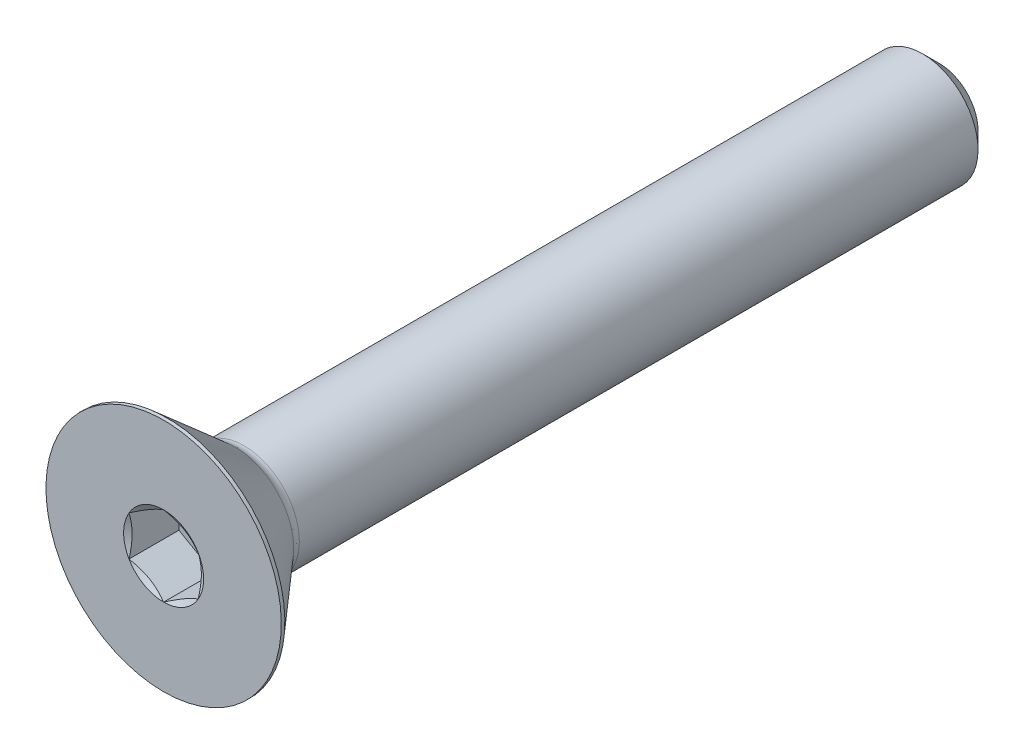
ISO-10303-21;
HEADER;
FILE_DESCRIPTION(('STEP AP214'),'2;1');
FILE_NAME('part.step','',(''),(''),'','','');
FILE_SCHEMA(('AUTOMOTIVE_DESIGN { 1 0 10303 214 1 1 1 1 }'));
ENDSEC;
DATA;
#1=APPLICATION_CONTEXT('core data for automotive mechanical design processes');
#2=APPLICATION_PROTOCOL_DEFINITION('international standard','automotive_design',2000,#1);
#3=PRODUCT_CONTEXT('',#1,'mechanical');
#4=PRODUCT('Part','Part','',(#3));
#5=PRODUCT_RELATED_PRODUCT_CATEGORY('part','',(#4));
#6=PRODUCT_DEFINITION_FORMATION('','',#4);
#7=PRODUCT_DEFINITION_CONTEXT('part definition',#1,'design');
#8=PRODUCT_DEFINITION('design','',#6,#7);
#9=PRODUCT_DEFINITION_SHAPE('','',#8);
#10=(LENGTH_UNIT() NAMED_UNIT(*) SI_UNIT(.MILLI.,.METRE.));
#11=(NAMED_UNIT(*) PLANE_ANGLE_UNIT() SI_UNIT($,.RADIAN.));
#12=(NAMED_UNIT(*) SI_UNIT($,.STERADIAN.) SOLID_ANGLE_UNIT());
#13=UNCERTAINTY_MEASURE_WITH_UNIT(LENGTH_MEASURE(1.E-05),#10,'distance_accuracy_value','');
#14=(GEOMETRIC_REPRESENTATION_CONTEXT(3) GLOBAL_UNCERTAINTY_ASSIGNED_CONTEXT((#13)) GLOBAL_UNIT_ASSIGNED_CONTEXT((#10,
#11,#12)) REPRESENTATION_CONTEXT('',''));
#15=CARTESIAN_POINT('',(0.,0.,0.));
#16=DIRECTION('',(0.,0.,1.));
#17=DIRECTION('',(1.,0.,0.));
#18=AXIS2_PLACEMENT_3D('',#15,#16,#17);
#19=CARTESIAN_POINT('',(0.,0.,-44.45));
#20=DIRECTION('',(0.,0.,-1.));
#21=DIRECTION('',(0.,1.,0.));
#22=AXIS2_PLACEMENT_3D('',#19,#20,#21);
#23=CYLINDRICAL_SURFACE('',#22,3.175);
#24=CARTESIAN_POINT('',(0.,0.,-4.60180899712601));
#25=DIRECTION('',(0.,0.,1.));
#26=DIRECTION('',(0.,-1.,0.));
#27=AXIS2_PLACEMENT_3D('',#24,#25,#26);
#28=CIRCLE('',#27,3.175);
#29=CARTESIAN_POINT('',(0.,-3.17500000000001,-4.60180899712601));
#30=VERTEX_POINT('',#29);
#31=EDGE_CURVE('E211',#30,#30,#28,.T.);
#32=ORIENTED_EDGE('',*,*,#31,.F.);
#33=EDGE_LOOP('',(#32));
#34=FACE_BOUND('',#33,.T.);
#35=CARTESIAN_POINT('',(0.,0.,-43.4975));
#36=DIRECTION('',(0.,0.,-1.));
#37=DIRECTION('',(0.,1.,0.));
#38=AXIS2_PLACEMENT_3D('',#35,#36,#37);
#39=CIRCLE('',#38,3.175);
#40=CARTESIAN_POINT('',(0.,3.17500000000001,-43.4975));
#41=VERTEX_POINT('',#40);
#42=EDGE_CURVE('E48',#41,#41,#39,.F.);
#43=ORIENTED_EDGE('',*,*,#42,.T.);
#44=EDGE_LOOP('',(#43));
#45=FACE_BOUND('',#44,.T.);
#46=ADVANCED_FACE('F34',(#34,#45),#23,.T.);
#47=CARTESIAN_POINT('',(0.,-3.175,-44.45));
#48=DIRECTION('',(0.,0.,-1.));
#49=DIRECTION('',(0.,1.,0.));
#50=AXIS2_PLACEMENT_3D('',#47,#48,#49);
#51=PLANE('',#50);
#52=CARTESIAN_POINT('',(0.,0.,-44.45));
#53=DIRECTION('',(0.,0.,-1.));
#54=DIRECTION('',(0.,1.,0.));
#55=AXIS2_PLACEMENT_3D('',#52,#53,#54);
#56=CIRCLE('',#55,2.22250000000001);
#57=CARTESIAN_POINT('',(0.,2.22250000000001,-44.45));
#58=VERTEX_POINT('',#57);
#59=EDGE_CURVE('E214',#58,#58,#56,.T.);
#60=ORIENTED_EDGE('',*,*,#59,.T.);
#61=EDGE_LOOP('',(#60));
#62=FACE_BOUND('',#61,.T.);
#63=ADVANCED_FACE('F223',(#62),#51,.T.);
#64=CARTESIAN_POINT('',(0.,0.,-44.45));
#65=DIRECTION('',(0.,0.,1.));
#66=DIRECTION('',(0.,-1.,0.));
#67=AXIS2_PLACEMENT_3D('',#64,#65,#66);
#68=CONICAL_SURFACE('',#67,2.22250000000001,0.785398163397447);
#69=ORIENTED_EDGE('',*,*,#42,.F.);
#70=EDGE_LOOP('',(#69));
#71=FACE_BOUND('',#70,.T.);
#72=ORIENTED_EDGE('',*,*,#59,.F.);
#73=EDGE_LOOP('',(#72));
#74=FACE_BOUND('',#73,.T.);
#75=ADVANCED_FACE('F36',(#71,#74),#68,.T.);
#76=CARTESIAN_POINT('',(0.,0.,-4.60180899712601));
#77=DIRECTION('',(0.,0.,1.));
#78=DIRECTION('',(0.,-1.,0.));
#79=AXIS2_PLACEMENT_3D('',#76,#77,#78);
#80=TOROIDAL_SURFACE('',#79,3.95604099552516,0.78104099552515);
#81=CARTESIAN_POINT('',(0.,0.,-4.0894));
#82=DIRECTION('',(0.,0.,1.));
#83=DIRECTION('',(0.,-1.,0.));
#84=AXIS2_PLACEMENT_3D('',#81,#82,#83);
#85=CIRCLE('',#84,3.36658187365559);
#86=CARTESIAN_POINT('',(0.,-3.36658187365559,-4.0894));
#87=VERTEX_POINT('',#86);
#88=EDGE_CURVE('E208',#87,#87,#85,.T.);
#89=ORIENTED_EDGE('',*,*,#88,.F.);
#90=EDGE_LOOP('',(#89));
#91=FACE_BOUND('',#90,.T.);
#92=ORIENTED_EDGE('',*,*,#31,.T.);
#93=EDGE_LOOP('',(#92));
#94=FACE_BOUND('',#93,.T.);
#95=ADVANCED_FACE('F222',(#91,#94),#80,.F.);
#96=CARTESIAN_POINT('',(0.,0.,-4.0894));
#97=DIRECTION('',(0.,0.,1.));
#98=DIRECTION('',(0.,-1.,0.));
#99=AXIS2_PLACEMENT_3D('',#96,#97,#98);
#100=CONICAL_SURFACE('',#99,3.36658187365559,0.715584993317677);
#101=CARTESIAN_POINT('',(0.,0.,-0.204469999999999));
#102=DIRECTION('',(0.,0.,1.));
#103=DIRECTION('',(0.,-1.,0.));
#104=AXIS2_PLACEMENT_3D('',#101,#102,#103);
#105=CIRCLE('',#104,6.7437);
#106=CARTESIAN_POINT('',(0.,-6.7437,-0.204469999999999));
#107=VERTEX_POINT('',#106);
#108=EDGE_CURVE('E205',#107,#107,#105,.T.);
#109=ORIENTED_EDGE('',*,*,#108,.F.);
#110=EDGE_LOOP('',(#109));
#111=FACE_BOUND('',#110,.T.);
#112=ORIENTED_EDGE('',*,*,#88,.T.);
#113=EDGE_LOOP('',(#112));
#114=FACE_BOUND('',#113,.T.);
#115=ADVANCED_FACE('F236',(#111,#114),#100,.T.);
#116=CARTESIAN_POINT('',(0.,0.,0.));
#117=DIRECTION('',(0.,0.,1.));
#118=DIRECTION('',(0.,-1.,0.));
#119=AXIS2_PLACEMENT_3D('',#116,#117,#118);
#120=CYLINDRICAL_SURFACE('',#119,6.7437);
#121=CARTESIAN_POINT('',(0.,0.,0.));
#122=DIRECTION('',(0.,0.,1.));
#123=DIRECTION('',(0.,-1.,0.));
#124=AXIS2_PLACEMENT_3D('',#121,#122,#123);
#125=CIRCLE('',#124,6.7437);
#126=CARTESIAN_POINT('',(0.,-6.7437,0.));
#127=VERTEX_POINT('',#126);
#128=EDGE_CURVE('E193',#127,#127,#125,.T.);
#129=ORIENTED_EDGE('',*,*,#128,.F.);
#130=EDGE_LOOP('',(#129));
#131=FACE_BOUND('',#130,.T.);
#132=ORIENTED_EDGE('',*,*,#108,.T.);
#133=EDGE_LOOP('',(#132));
#134=FACE_BOUND('',#133,.T.);
#135=ADVANCED_FACE('F166',(#131,#134),#120,.T.);
#136=CARTESIAN_POINT('',(0.,-3.175,0.));
#137=DIRECTION('',(0.,0.,1.));
#138=DIRECTION('',(0.,-1.,0.));
#139=AXIS2_PLACEMENT_3D('',#136,#137,#138);
#140=PLANE('',#139);
#141=CARTESIAN_POINT('',(0.,0.,0.));
#142=DIRECTION('',(0.,0.,1.));
#143=DIRECTION('',(1.,0.,0.));
#144=AXIS2_PLACEMENT_3D('',#141,#142,#143);
#145=CIRCLE('',#144,2.29135888084633);
#146=CARTESIAN_POINT('',(0.,-2.29135888084633,0.));
#147=VERTEX_POINT('',#146);
#148=CARTESIAN_POINT('',(1.984375,-1.14567944042316,0.));
#149=VERTEX_POINT('',#148);
#150=EDGE_CURVE('E61',#147,#149,#145,.T.);
#151=ORIENTED_EDGE('',*,*,#150,.F.);
#152=CARTESIAN_POINT('',(-1.984375,-1.14567944042316,0.));
#153=VERTEX_POINT('',#152);
#154=EDGE_CURVE('E133',#153,#147,#145,.T.);
#155=ORIENTED_EDGE('',*,*,#154,.F.);
#156=CARTESIAN_POINT('',(-1.984375,1.14567944042317,0.));
#157=VERTEX_POINT('',#156);
#158=EDGE_CURVE('E132',#157,#153,#145,.T.);
#159=ORIENTED_EDGE('',*,*,#158,.F.);
#160=CARTESIAN_POINT('',(0.,2.29135888084633,0.));
#161=VERTEX_POINT('',#160);
#162=EDGE_CURVE('E102',#161,#157,#145,.T.);
#163=ORIENTED_EDGE('',*,*,#162,.F.);
#164=CARTESIAN_POINT('',(1.984375,1.14567944042316,0.));
#165=VERTEX_POINT('',#164);
#166=EDGE_CURVE('E93',#165,#161,#145,.T.);
#167=ORIENTED_EDGE('',*,*,#166,.F.);
#168=EDGE_CURVE('E54',#149,#165,#145,.T.);
#169=ORIENTED_EDGE('',*,*,#168,.F.);
#170=EDGE_LOOP('',(#151,#155,#159,#163,#167,#169));
#171=FACE_BOUND('',#170,.T.);
#172=ORIENTED_EDGE('',*,*,#128,.T.);
#173=EDGE_LOOP('',(#172));
#174=FACE_BOUND('',#173,.T.);
#175=ADVANCED_FACE('F128',(#171,#174),#140,.T.);
#176=CARTESIAN_POINT('',(0.,0.,0.));
#177=DIRECTION('',(0.,0.,1.));
#178=DIRECTION('',(1.,0.,0.));
#179=AXIS2_PLACEMENT_3D('',#176,#177,#178);
#180=CONICAL_SURFACE('',#179,2.29135888084633,1.0471975511966);
#181=ORIENTED_EDGE('',*,*,#162,.T.);
#182=CARTESIAN_POINT('',(0.000199999999999609,2.29147435090017,6.66717057831416E-05));
#183=CARTESIAN_POINT('',(-0.0870046387806768,2.24112672922556,-0.029014317759813));
#184=CARTESIAN_POINT('',(-0.174962019304997,2.19034451190263,-0.0554627919729485));
#185=CARTESIAN_POINT('',(-0.35239997867232,2.08790065829745,-0.101629728793529));
#186=CARTESIAN_POINT('',(-0.441883711256319,2.03623720120198,-0.121331857751036));
#187=CARTESIAN_POINT('',(-0.619742148012469,1.93355058486317,-0.152002268068471));
#188=CARTESIAN_POINT('',(-0.708089480306094,1.88254322878126,-0.163174657279787));
#189=CARTESIAN_POINT('',(-0.88520002811095,1.78028840632981,-0.176514203945575));
#190=CARTESIAN_POINT('',(-0.973962599510547,1.72904131183829,-0.178692405539878));
#191=CARTESIAN_POINT('',(-1.13983230286466,1.63327639395638,-0.174170448491651));
#192=CARTESIAN_POINT('',(-1.21696421566591,1.58874426333747,-0.168580586544127));
#193=CARTESIAN_POINT('',(-1.37072550718908,1.49997014028563,-0.150861066102989));
#194=CARTESIAN_POINT('',(-1.44735435374552,1.45572845509857,-0.138725349670475));
#195=CARTESIAN_POINT('',(-1.60143288850678,1.36677117157782,-0.108385841155635));
#196=CARTESIAN_POINT('',(-1.67886306721268,1.32206683705857,-0.09005339070901));
#197=CARTESIAN_POINT('',(-1.83256831124359,1.23332507304146,-0.0484454935998176));
#198=CARTESIAN_POINT('',(-1.90884534705293,1.18928650588395,-0.0251798287176209));
#199=CARTESIAN_POINT('',(-1.984575,1.14556397036933,6.66717057829762E-05));
#200=B_SPLINE_CURVE_WITH_KNOTS('',3,(#182,#183,#184,#185,#186,#187,#188,#189,#190,#191,#192,
#193,#194,#195,#196,#197,#198,#199),.UNSPECIFIED.,.F.,.F.,(4,2,2,2,2,2,2,2,4),(0.,
0.314555137114086,0.629866549668806,0.937373439505933,1.24450262309398,1.51196650590478,
1.77967834211415,2.05332989762155,2.32644383656793),.UNSPECIFIED.);
#201=EDGE_CURVE('E11',#161,#157,#200,.T.);
#202=ORIENTED_EDGE('',*,*,#201,.F.);
#203=EDGE_LOOP('',(#181,#202));
#204=FACE_BOUND('',#203,.T.);
#205=ADVANCED_FACE('F106',(#204),#180,.F.);
#206=ORIENTED_EDGE('',*,*,#158,.T.);
#207=CARTESIAN_POINT('',(-1.984375,-2.96692860034507,0.737860651092377));
#208=CARTESIAN_POINT('',(-1.984375,-2.88123645369667,0.69674880177529));
#209=CARTESIAN_POINT('',(-1.984375,-2.79533554929687,0.656063972956056));
#210=CARTESIAN_POINT('',(-1.984375,-2.62300496253372,0.575790597945192));
#211=CARTESIAN_POINT('',(-1.984375,-2.53657518838115,0.536202249047077));
#212=CARTESIAN_POINT('',(-1.984375,-2.36258003650985,0.458142914429596));
#213=CARTESIAN_POINT('',(-1.984375,-2.27501095051754,0.419680163398946));
#214=CARTESIAN_POINT('',(-1.984375,-2.09913795632987,0.344479427097519));
#215=CARTESIAN_POINT('',(-1.984375,-2.01083408662377,0.307741352146445));
#216=CARTESIAN_POINT('',(-1.984375,-1.83102497893539,0.235513729354963));
#217=CARTESIAN_POINT('',(-1.984375,-1.73949640320228,0.200081939073892));
#218=CARTESIAN_POINT('',(-1.984375,-1.55533214713673,0.132164183556778));
#219=CARTESIAN_POINT('',(-1.984375,-1.46269633980312,0.0996785599926462));
#220=CARTESIAN_POINT('',(-1.984375,-1.27638419434466,0.0385821363592113));
#221=CARTESIAN_POINT('',(-1.984375,-1.18271082678456,0.00996237523819853));
#222=CARTESIAN_POINT('',(-1.984375,-0.994021652382587,-0.0424236311394211));
#223=CARTESIAN_POINT('',(-1.984375,-0.899006185229732,-0.0661910818015453));
#224=CARTESIAN_POINT('',(-1.984375,-0.70783051245842,-0.107605260619429));
#225=CARTESIAN_POINT('',(-1.984375,-0.611673084373239,-0.125264559933971));
#226=CARTESIAN_POINT('',(-1.984375,-0.418283092113672,-0.153306903466505));
#227=CARTESIAN_POINT('',(-1.984375,-0.32105060104525,-0.163690439394072));
#228=CARTESIAN_POINT('',(-1.984375,-0.127210752774483,-0.176214799009401));
#229=CARTESIAN_POINT('',(-1.984375,-0.0306098639781231,-0.178452892631436));
#230=CARTESIAN_POINT('',(-1.984375,0.162431915887106,-0.17475795296783));
#231=CARTESIAN_POINT('',(-1.984375,0.258872796678698,-0.168824413724938));
#232=CARTESIAN_POINT('',(-1.984375,0.496826477184735,-0.144624426308478));
#233=CARTESIAN_POINT('',(-1.984375,0.637878211825128,-0.121822779785831));
#234=CARTESIAN_POINT('',(-1.984375,0.91723870370253,-0.0630239757386336));
#235=CARTESIAN_POINT('',(-1.984375,1.05554394232965,-0.0270109144574765));
#236=CARTESIAN_POINT('',(-1.984375,1.26239464896717,0.0345082078903479));
#237=CARTESIAN_POINT('',(-1.984375,1.33200934564274,0.0565514264145546));
#238=CARTESIAN_POINT('',(-1.984375,1.47051409380588,0.102676986257499));
#239=CARTESIAN_POINT('',(-1.984375,1.53940456776433,0.126758055006123));
#240=CARTESIAN_POINT('',(-1.984375,1.67655293465251,0.176609588689456));
#241=CARTESIAN_POINT('',(-1.984375,1.74481093998431,0.202379746602285));
#242=CARTESIAN_POINT('',(-1.984375,1.88078910071683,0.255330712681564));
#243=CARTESIAN_POINT('',(-1.984375,1.94850916300286,0.282511759182964));
#244=CARTESIAN_POINT('',(-1.984375,2.12136731788458,0.353633623835928));
#245=CARTESIAN_POINT('',(-1.984375,2.22615977384556,0.398413596701326));
#246=CARTESIAN_POINT('',(-1.984375,2.43479837304527,0.490132195682473));
#247=CARTESIAN_POINT('',(-1.984375,2.5386444446916,0.537070983511256));
#248=CARTESIAN_POINT('',(-1.984375,2.84907841644385,0.680364561323518));
#249=CARTESIAN_POINT('',(-1.984375,3.05452739791262,0.77918187526435));
#250=CARTESIAN_POINT('',(-1.984375,3.46367014223902,0.980960885724764));
#251=CARTESIAN_POINT('',(-1.984375,3.66736143684958,1.08392752775299));
#252=CARTESIAN_POINT('',(-1.984375,4.07334844866211,1.29250841655482));
#253=CARTESIAN_POINT('',(-1.984375,4.27564433912763,1.39812232679349));
#254=CARTESIAN_POINT('',(-1.984375,4.66022184962415,1.60111933686162));
#255=CARTESIAN_POINT('',(-1.984375,4.84259034249047,1.69833842729249));
#256=CARTESIAN_POINT('',(-1.984375,5.20674070245669,1.89388432048827));
#257=CARTESIAN_POINT('',(-1.984375,5.38852254752481,1.99221116424656));
#258=CARTESIAN_POINT('',(-1.984375,5.75117247931181,2.18944361750704));
#259=CARTESIAN_POINT('',(-1.984375,5.93204171415673,2.2883471187779));
#260=CARTESIAN_POINT('',(-1.984375,6.29341450955436,2.48679783989033));
#261=CARTESIAN_POINT('',(-1.984375,6.47391808874828,2.5863450257738));
#262=CARTESIAN_POINT('',(-1.984375,6.6542902961452,2.6861282522634));
#263=B_SPLINE_CURVE_WITH_KNOTS('',3,(#207,#208,#209,#210,#211,#212,#213,#214,#215,#216,#217,
#218,#219,#220,#221,#222,#223,#224,#225,#226,#227,#228,#229,#230,#231,#232,#233,#234,#235,#236,
#237,#238,#239,#240,#241,#242,#243,#244,#245,#246,#247,#248,#249,#250,#251,#252,#253,#254,#255,
#256,#257,#258,#259,#260,#261,#262),.UNSPECIFIED.,.F.,.F.,(4,2,2,2,2,2,2,2,2,2,2,2,2,2,2,2,2,2,
2,2,2,2,2,2,2,2,2,4),(0.,0.285135519832373,0.570322016122788,0.857238463819792,1.14413997577449,
1.43854271801315,1.7329795590899,2.02672173491208,2.32039085060263,2.61345191984504,
2.90649318156653,3.19602335108128,3.48557144803805,3.91334047285799,4.34162614021154,
4.56066589824458,4.77956986852721,4.99843415889189,5.21733554208811,5.55917796423187,
5.90104603503021,6.58489509249957,7.26958483186157,7.95418796687477,8.57417425374278,
9.1941835596094,9.81261585701217,10.431015790458),.UNSPECIFIED.);
#264=EDGE_CURVE('E101',#157,#153,#263,.F.);
#265=ORIENTED_EDGE('',*,*,#264,.F.);
#266=EDGE_LOOP('',(#206,#265));
#267=FACE_BOUND('',#266,.T.);
#268=ADVANCED_FACE('F264',(#267),#180,.F.);
#269=ORIENTED_EDGE('',*,*,#154,.T.);
#270=CARTESIAN_POINT('',(-1.984575,-1.14556397036933,6.66717057829649E-05));
#271=CARTESIAN_POINT('',(-1.89737036121932,-1.19591159204393,-0.0290143177598132));
#272=CARTESIAN_POINT('',(-1.809412980695,-1.24669380936686,-0.0554627919729487));
#273=CARTESIAN_POINT('',(-1.63197502132768,-1.34913766297205,-0.101629728793529));
#274=CARTESIAN_POINT('',(-1.54249128874368,-1.40080112006751,-0.121331857751037));
#275=CARTESIAN_POINT('',(-1.36463285198753,-1.50348773640632,-0.152002268068471));
#276=CARTESIAN_POINT('',(-1.27628551969391,-1.55449509248823,-0.163174657279787));
#277=CARTESIAN_POINT('',(-1.09917497188905,-1.65674991493968,-0.176514203945575));
#278=CARTESIAN_POINT('',(-1.01041240048945,-1.70799700943121,-0.178692405539878));
#279=CARTESIAN_POINT('',(-0.844542697135338,-1.80376192731311,-0.174170448491652));
#280=CARTESIAN_POINT('',(-0.767410784334093,-1.84829405793202,-0.168580586544128));
#281=CARTESIAN_POINT('',(-0.613649492810919,-1.93706818098387,-0.150861066102989));
#282=CARTESIAN_POINT('',(-0.537020646254476,-1.98130986617092,-0.138725349670476));
#283=CARTESIAN_POINT('',(-0.382942111493217,-2.07026714969167,-0.108385841155636));
#284=CARTESIAN_POINT('',(-0.305511932787318,-2.11497148421093,-0.0900533907090107));
#285=CARTESIAN_POINT('',(-0.151806688756412,-2.20371324822803,-0.0484454935998183));
#286=CARTESIAN_POINT('',(-0.075529652947068,-2.24775181538554,-0.0251798287176216));
#287=CARTESIAN_POINT('',(0.000199999999999772,-2.29147435090016,6.66717057822253E-05));
#288=B_SPLINE_CURVE_WITH_KNOTS('',3,(#270,#271,#272,#273,#274,#275,#276,#277,#278,#279,#280,
#281,#282,#283,#284,#285,#286,#287),.UNSPECIFIED.,.F.,.F.,(4,2,2,2,2,2,2,2,4),(0.,
0.314555137114086,0.629866549668806,0.937373439505932,1.24450262309398,1.51196650590478,
1.77967834211415,2.05332989762155,2.32644383656793),.UNSPECIFIED.);
#289=EDGE_CURVE('E142',#153,#147,#288,.T.);
#290=ORIENTED_EDGE('',*,*,#289,.F.);
#291=EDGE_LOOP('',(#269,#290));
#292=FACE_BOUND('',#291,.T.);
#293=ADVANCED_FACE('F270',(#292),#180,.F.);
#294=ORIENTED_EDGE('',*,*,#150,.T.);
#295=CARTESIAN_POINT('',(-0.000200000000000051,-2.29147435090016,6.66717057826408E-05));
#296=CARTESIAN_POINT('',(0.0870046387806763,-2.24112672922556,-0.0290143177598132));
#297=CARTESIAN_POINT('',(0.174962019304996,-2.19034451190263,-0.0554627919729487));
#298=CARTESIAN_POINT('',(0.352399978672319,-2.08790065829744,-0.101629728793529));
#299=CARTESIAN_POINT('',(0.441883711256319,-2.03623720120198,-0.121331857751037));
#300=CARTESIAN_POINT('',(0.619742148012468,-1.93355058486317,-0.152002268068471));
#301=CARTESIAN_POINT('',(0.708089480306093,-1.88254322878126,-0.163174657279787));
#302=CARTESIAN_POINT('',(0.885200028110949,-1.78028840632981,-0.176514203945575));
#303=CARTESIAN_POINT('',(0.973962599510546,-1.72904131183829,-0.178692405539878));
#304=CARTESIAN_POINT('',(1.13983230286466,-1.63327639395638,-0.174170448491652));
#305=CARTESIAN_POINT('',(1.21696421566591,-1.58874426333747,-0.168580586544128));
#306=CARTESIAN_POINT('',(1.37072550718908,-1.49997014028563,-0.150861066102989));
#307=CARTESIAN_POINT('',(1.44735435374552,-1.45572845509857,-0.138725349670476));
#308=CARTESIAN_POINT('',(1.60143288850678,-1.36677117157782,-0.108385841155636));
#309=CARTESIAN_POINT('',(1.67886306721268,-1.32206683705856,-0.0900533907090105));
#310=CARTESIAN_POINT('',(1.83256831124359,-1.23332507304146,-0.0484454935998179));
#311=CARTESIAN_POINT('',(1.90884534705293,-1.18928650588395,-0.0251798287176211));
#312=CARTESIAN_POINT('',(1.984575,-1.14556397036933,6.66717057827258E-05));
#313=B_SPLINE_CURVE_WITH_KNOTS('',3,(#295,#296,#297,#298,#299,#300,#301,#302,#303,#304,#305,
#306,#307,#308,#309,#310,#311,#312),.UNSPECIFIED.,.F.,.F.,(4,2,2,2,2,2,2,2,4),(0.,
0.314555137114085,0.629866549668806,0.937373439505932,1.24450262309398,1.51196650590478,
1.77967834211415,2.05332989762155,2.32644383656793),.UNSPECIFIED.);
#314=EDGE_CURVE('E393',#147,#149,#313,.T.);
#315=ORIENTED_EDGE('',*,*,#314,.F.);
#316=EDGE_LOOP('',(#294,#315));
#317=FACE_BOUND('',#316,.T.);
#318=ADVANCED_FACE('F277',(#317),#180,.F.);
#319=ORIENTED_EDGE('',*,*,#168,.T.);
#320=CARTESIAN_POINT('',(1.984375,-2.96692860034507,0.737860651092378));
#321=CARTESIAN_POINT('',(1.984375,-2.88123645369666,0.69674880177529));
#322=CARTESIAN_POINT('',(1.984375,-2.79533554929687,0.656063972956056));
#323=CARTESIAN_POINT('',(1.984375,-2.62300496253372,0.575790597945192));
#324=CARTESIAN_POINT('',(1.984375,-2.53657518838115,0.536202249047077));
#325=CARTESIAN_POINT('',(1.984375,-2.36258003650985,0.458142914429596));
#326=CARTESIAN_POINT('',(1.984375,-2.27501095051754,0.419680163398946));
#327=CARTESIAN_POINT('',(1.984375,-2.09913795632987,0.344479427097519));
#328=CARTESIAN_POINT('',(1.984375,-2.01083408662377,0.307741352146445));
#329=CARTESIAN_POINT('',(1.984375,-1.83102497893539,0.235513729354964));
#330=CARTESIAN_POINT('',(1.984375,-1.73949640320228,0.200081939073892));
#331=CARTESIAN_POINT('',(1.984375,-1.55533214713673,0.132164183556778));
#332=CARTESIAN_POINT('',(1.984375,-1.46269633980312,0.0996785599926464));
#333=CARTESIAN_POINT('',(1.984375,-1.27638419434466,0.0385821363592116));
#334=CARTESIAN_POINT('',(1.984375,-1.18271082678456,0.00996237523819882));
#335=CARTESIAN_POINT('',(1.984375,-0.994021652382587,-0.042423631139421));
#336=CARTESIAN_POINT('',(1.984375,-0.899006185229731,-0.0661910818015453));
#337=CARTESIAN_POINT('',(1.984375,-0.70783051245842,-0.107605260619429));
#338=CARTESIAN_POINT('',(1.984375,-0.611673084373239,-0.125264559933971));
#339=CARTESIAN_POINT('',(1.984375,-0.418283092113671,-0.153306903466505));
#340=CARTESIAN_POINT('',(1.984375,-0.32105060104525,-0.163690439394072));
#341=CARTESIAN_POINT('',(1.984375,-0.127210752774482,-0.176214799009401));
#342=CARTESIAN_POINT('',(1.984375,-0.0306098639781227,-0.178452892631436));
#343=CARTESIAN_POINT('',(1.984375,0.162431915887107,-0.17475795296783));
#344=CARTESIAN_POINT('',(1.984375,0.258872796678699,-0.168824413724938));
#345=CARTESIAN_POINT('',(1.984375,0.496826477184735,-0.144624426308478));
#346=CARTESIAN_POINT('',(1.984375,0.637878211825129,-0.12182277978583));
#347=CARTESIAN_POINT('',(1.984375,0.91723870370253,-0.0630239757386333));
#348=CARTESIAN_POINT('',(1.984375,1.05554394232965,-0.0270109144574763));
#349=CARTESIAN_POINT('',(1.984375,1.26239464896717,0.0345082078903483));
#350=CARTESIAN_POINT('',(1.984375,1.33200934564274,0.0565514264145553));
#351=CARTESIAN_POINT('',(1.984375,1.47051409380588,0.1026769862575));
#352=CARTESIAN_POINT('',(1.984375,1.53940456776433,0.126758055006124));
#353=CARTESIAN_POINT('',(1.984375,1.67655293465251,0.176609588689457));
#354=CARTESIAN_POINT('',(1.984375,1.74481093998432,0.202379746602286));
#355=CARTESIAN_POINT('',(1.984375,1.88078910071683,0.255330712681565));
#356=CARTESIAN_POINT('',(1.984375,1.94850916300287,0.282511759182965));
#357=CARTESIAN_POINT('',(1.984375,2.12136731788458,0.353633623835929));
#358=CARTESIAN_POINT('',(1.984375,2.22615977384557,0.398413596701327));
#359=CARTESIAN_POINT('',(1.984375,2.43479837304527,0.490132195682473));
#360=CARTESIAN_POINT('',(1.984375,2.5386444446916,0.537070983511257));
#361=CARTESIAN_POINT('',(1.984375,2.84907841644385,0.680364561323519));
#362=CARTESIAN_POINT('',(1.984375,3.05452739791262,0.779181875264351));
#363=CARTESIAN_POINT('',(1.984375,3.46367014223902,0.980960885724765));
#364=CARTESIAN_POINT('',(1.984375,3.66736143684958,1.08392752775299));
#365=CARTESIAN_POINT('',(1.984375,4.07334844866211,1.29250841655482));
#366=CARTESIAN_POINT('',(1.984375,4.27564433912763,1.3981223267935));
#367=CARTESIAN_POINT('',(1.984375,4.66022184962416,1.60111933686162));
#368=CARTESIAN_POINT('',(1.984375,4.84259034249048,1.6983384272925));
#369=CARTESIAN_POINT('',(1.984375,5.2067407024567,1.89388432048827));
#370=CARTESIAN_POINT('',(1.984375,5.38852254752481,1.99221116424656));
#371=CARTESIAN_POINT('',(1.984375,5.75117247931181,2.18944361750704));
#372=CARTESIAN_POINT('',(1.984375,5.93204171415673,2.2883471187779));
#373=CARTESIAN_POINT('',(1.984375,6.29341450955436,2.48679783989034));
#374=CARTESIAN_POINT('',(1.984375,6.47391808874828,2.5863450257738));
#375=CARTESIAN_POINT('',(1.984375,6.6542902961452,2.6861282522634));
#376=B_SPLINE_CURVE_WITH_KNOTS('',3,(#320,#321,#322,#323,#324,#325,#326,#327,#328,#329,#330,
#331,#332,#333,#334,#335,#336,#337,#338,#339,#340,#341,#342,#343,#344,#345,#346,#347,#348,#349,
#350,#351,#352,#353,#354,#355,#356,#357,#358,#359,#360,#361,#362,#363,#364,#365,#366,#367,#368,
#369,#370,#371,#372,#373,#374,#375),.UNSPECIFIED.,.F.,.F.,(4,2,2,2,2,2,2,2,2,2,2,2,2,2,2,2,2,2,
2,2,2,2,2,2,2,2,2,4),(0.,0.285135519832374,0.570322016122787,0.857238463819791,1.14413997577449,
1.43854271801315,1.7329795590899,2.02672173491208,2.32039085060263,2.61345191984504,
2.90649318156653,3.19602335108128,3.48557144803805,3.91334047285799,4.34162614021154,
4.56066589824458,4.77956986852721,4.9984341588919,5.21733554208812,5.55917796423187,
5.90104603503021,6.58489509249957,7.26958483186157,7.95418796687478,8.57417425374278,
9.1941835596094,9.81261585701217,10.431015790458),.UNSPECIFIED.);
#377=EDGE_CURVE('E118',#149,#165,#376,.T.);
#378=ORIENTED_EDGE('',*,*,#377,.F.);
#379=EDGE_LOOP('',(#319,#378));
#380=FACE_BOUND('',#379,.T.);
#381=ADVANCED_FACE('F284',(#380),#180,.F.);
#382=ORIENTED_EDGE('',*,*,#166,.T.);
#383=CARTESIAN_POINT('',(1.984575,1.14556397036933,6.66717057832154E-05));
#384=CARTESIAN_POINT('',(1.89737036121932,1.19591159204393,-0.029014317759813));
#385=CARTESIAN_POINT('',(1.809412980695,1.24669380936687,-0.0554627919729485));
#386=CARTESIAN_POINT('',(1.63197502132768,1.34913766297205,-0.101629728793529));
#387=CARTESIAN_POINT('',(1.54249128874368,1.40080112006751,-0.121331857751036));
#388=CARTESIAN_POINT('',(1.36463285198753,1.50348773640632,-0.152002268068471));
#389=CARTESIAN_POINT('',(1.27628551969391,1.55449509248823,-0.163174657279786));
#390=CARTESIAN_POINT('',(1.09917497188905,1.65674991493969,-0.176514203945575));
#391=CARTESIAN_POINT('',(1.01041240048945,1.70799700943121,-0.178692405539878));
#392=CARTESIAN_POINT('',(0.844542697135338,1.80376192731311,-0.174170448491651));
#393=CARTESIAN_POINT('',(0.767410784334093,1.84829405793202,-0.168580586544127));
#394=CARTESIAN_POINT('',(0.613649492810919,1.93706818098387,-0.150861066102989));
#395=CARTESIAN_POINT('',(0.537020646254476,1.98130986617092,-0.138725349670475));
#396=CARTESIAN_POINT('',(0.382942111493217,2.07026714969167,-0.108385841155635));
#397=CARTESIAN_POINT('',(0.305511932787317,2.11497148421093,-0.0900533907090102));
#398=CARTESIAN_POINT('',(0.151806688756411,2.20371324822803,-0.0484454935998178));
#399=CARTESIAN_POINT('',(0.0755296529470672,2.24775181538554,-0.0251798287176211));
#400=CARTESIAN_POINT('',(-0.000200000000000537,2.29147435090017,6.6671705782726E-05));
#401=B_SPLINE_CURVE_WITH_KNOTS('',3,(#383,#384,#385,#386,#387,#388,#389,#390,#391,#392,#393,
#394,#395,#396,#397,#398,#399,#400),.UNSPECIFIED.,.F.,.F.,(4,2,2,2,2,2,2,2,4),(0.,
0.314555137114086,0.629866549668806,0.937373439505933,1.24450262309398,1.51196650590478,
1.77967834211415,2.05332989762155,2.32644383656793),.UNSPECIFIED.);
#402=EDGE_CURVE('E97',#165,#161,#401,.T.);
#403=ORIENTED_EDGE('',*,*,#402,.F.);
#404=EDGE_LOOP('',(#382,#403));
#405=FACE_BOUND('',#404,.T.);
#406=ADVANCED_FACE('F95',(#405),#180,.F.);
#407=CARTESIAN_POINT('',(0.,2.29135888084633,-2.86258));
#408=DIRECTION('',(0.,0.,1.));
#409=DIRECTION('',(1.,0.,0.));
#410=AXIS2_PLACEMENT_3D('',#407,#408,#409);
#411=PLANE('',#410);
#412=DIRECTION('',(-0.866025403784439,0.5,0.));
#413=VECTOR('',#412,1.);
#414=CARTESIAN_POINT('',(1.984375,1.14567944042317,-2.86258));
#415=LINE('',#414,#413);
#416=CARTESIAN_POINT('',(1.984375,1.14567944042317,-2.86258));
#417=VERTEX_POINT('',#416);
#418=CARTESIAN_POINT('',(0.,2.29135888084633,-2.86258));
#419=VERTEX_POINT('',#418);
#420=EDGE_CURVE('E117',#417,#419,#415,.T.);
#421=ORIENTED_EDGE('',*,*,#420,.T.);
#422=DIRECTION('',(-0.866025403784439,-0.5,0.));
#423=VECTOR('',#422,1.);
#424=CARTESIAN_POINT('',(0.,2.29135888084633,-2.86258));
#425=LINE('',#424,#423);
#426=CARTESIAN_POINT('',(-1.984375,1.14567944042316,-2.86258));
#427=VERTEX_POINT('',#426);
#428=EDGE_CURVE('E122',#419,#427,#425,.T.);
#429=ORIENTED_EDGE('',*,*,#428,.T.);
#430=DIRECTION('',(0.,-1.,0.));
#431=VECTOR('',#430,1.);
#432=CARTESIAN_POINT('',(-1.984375,1.14567944042316,-2.86258));
#433=LINE('',#432,#431);
#434=CARTESIAN_POINT('',(-1.984375,-1.14567944042316,-2.86258));
#435=VERTEX_POINT('',#434);
#436=EDGE_CURVE('E181',#427,#435,#433,.T.);
#437=ORIENTED_EDGE('',*,*,#436,.T.);
#438=DIRECTION('',(0.866025403784439,-0.5,0.));
#439=VECTOR('',#438,1.);
#440=CARTESIAN_POINT('',(-1.984375,-1.14567944042316,-2.86258));
#441=LINE('',#440,#439);
#442=CARTESIAN_POINT('',(0.,-2.29135888084633,-2.86258));
#443=VERTEX_POINT('',#442);
#444=EDGE_CURVE('E184',#435,#443,#441,.T.);
#445=ORIENTED_EDGE('',*,*,#444,.T.);
#446=DIRECTION('',(0.866025403784439,0.5,0.));
#447=VECTOR('',#446,1.);
#448=CARTESIAN_POINT('',(0.,-2.29135888084633,-2.86258));
#449=LINE('',#448,#447);
#450=CARTESIAN_POINT('',(1.984375,-1.14567944042316,-2.86258));
#451=VERTEX_POINT('',#450);
#452=EDGE_CURVE('E187',#443,#451,#449,.T.);
#453=ORIENTED_EDGE('',*,*,#452,.T.);
#454=DIRECTION('',(0.,1.,0.));
#455=VECTOR('',#454,1.);
#456=CARTESIAN_POINT('',(1.984375,-1.14567944042316,-2.86258));
#457=LINE('',#456,#455);
#458=EDGE_CURVE('E125',#451,#417,#457,.T.);
#459=ORIENTED_EDGE('',*,*,#458,.T.);
#460=EDGE_LOOP('',(#421,#429,#437,#445,#453,#459));
#461=FACE_BOUND('',#460,.T.);
#462=ADVANCED_FACE('F161',(#461),#411,.T.);
#463=CARTESIAN_POINT('',(0.,2.29135888084633,-2.86258));
#464=DIRECTION('',(-0.5,0.866025403784439,0.));
#465=DIRECTION('',(-0.866025403784439,-0.5,0.));
#466=AXIS2_PLACEMENT_3D('',#463,#464,#465);
#467=PLANE('',#466);
#468=DIRECTION('',(0.,0.,1.));
#469=VECTOR('',#468,1.);
#470=CARTESIAN_POINT('',(0.,2.29135888084633,-2.86258));
#471=LINE('',#470,#469);
#472=EDGE_CURVE('E114',#419,#161,#471,.T.);
#473=ORIENTED_EDGE('',*,*,#472,.T.);
#474=ORIENTED_EDGE('',*,*,#201,.T.);
#475=DIRECTION('',(0.,0.,1.));
#476=VECTOR('',#475,1.);
#477=CARTESIAN_POINT('',(-1.984375,1.14567944042316,-2.86258));
#478=LINE('',#477,#476);
#479=EDGE_CURVE('E124',#427,#157,#478,.T.);
#480=ORIENTED_EDGE('',*,*,#479,.F.);
#481=ORIENTED_EDGE('',*,*,#428,.F.);
#482=EDGE_LOOP('',(#473,#474,#480,#481));
#483=FACE_BOUND('',#482,.T.);
#484=ADVANCED_FACE('F120',(#483),#467,.F.);
#485=CARTESIAN_POINT('',(-1.984375,1.14567944042316,-2.86258));
#486=DIRECTION('',(-1.,0.,0.));
#487=DIRECTION('',(0.,-1.,0.));
#488=AXIS2_PLACEMENT_3D('',#485,#486,#487);
#489=PLANE('',#488);
#490=ORIENTED_EDGE('',*,*,#479,.T.);
#491=ORIENTED_EDGE('',*,*,#264,.T.);
#492=DIRECTION('',(0.,0.,1.));
#493=VECTOR('',#492,1.);
#494=CARTESIAN_POINT('',(-1.984375,-1.14567944042316,-2.86258));
#495=LINE('',#494,#493);
#496=EDGE_CURVE('E200',#435,#153,#495,.T.);
#497=ORIENTED_EDGE('',*,*,#496,.F.);
#498=ORIENTED_EDGE('',*,*,#436,.F.);
#499=EDGE_LOOP('',(#490,#491,#497,#498));
#500=FACE_BOUND('',#499,.T.);
#501=ADVANCED_FACE('F151',(#500),#489,.F.);
#502=CARTESIAN_POINT('',(-1.984375,-1.14567944042316,-2.86258));
#503=DIRECTION('',(-0.5,-0.866025403784439,0.));
#504=DIRECTION('',(0.866025403784439,-0.5,0.));
#505=AXIS2_PLACEMENT_3D('',#502,#503,#504);
#506=PLANE('',#505);
#507=ORIENTED_EDGE('',*,*,#496,.T.);
#508=ORIENTED_EDGE('',*,*,#289,.T.);
#509=DIRECTION('',(0.,0.,1.));
#510=VECTOR('',#509,1.);
#511=CARTESIAN_POINT('',(0.,-2.29135888084633,-2.86258));
#512=LINE('',#511,#510);
#513=EDGE_CURVE('E197',#443,#147,#512,.T.);
#514=ORIENTED_EDGE('',*,*,#513,.F.);
#515=ORIENTED_EDGE('',*,*,#444,.F.);
#516=EDGE_LOOP('',(#507,#508,#514,#515));
#517=FACE_BOUND('',#516,.T.);
#518=ADVANCED_FACE('F154',(#517),#506,.F.);
#519=CARTESIAN_POINT('',(0.,-2.29135888084633,-2.86258));
#520=DIRECTION('',(0.5,-0.866025403784439,0.));
#521=DIRECTION('',(0.866025403784439,0.5,0.));
#522=AXIS2_PLACEMENT_3D('',#519,#520,#521);
#523=PLANE('',#522);
#524=ORIENTED_EDGE('',*,*,#513,.T.);
#525=ORIENTED_EDGE('',*,*,#314,.T.);
#526=DIRECTION('',(0.,0.,1.));
#527=VECTOR('',#526,1.);
#528=CARTESIAN_POINT('',(1.984375,-1.14567944042316,-2.86258));
#529=LINE('',#528,#527);
#530=EDGE_CURVE('E194',#451,#149,#529,.T.);
#531=ORIENTED_EDGE('',*,*,#530,.F.);
#532=ORIENTED_EDGE('',*,*,#452,.F.);
#533=EDGE_LOOP('',(#524,#525,#531,#532));
#534=FACE_BOUND('',#533,.T.);
#535=ADVANCED_FACE('F313',(#534),#523,.F.);
#536=CARTESIAN_POINT('',(1.984375,-1.14567944042316,-2.86258));
#537=DIRECTION('',(1.,0.,0.));
#538=DIRECTION('',(0.,0.,-1.));
#539=AXIS2_PLACEMENT_3D('',#536,#537,#538);
#540=PLANE('',#539);
#541=ORIENTED_EDGE('',*,*,#530,.T.);
#542=ORIENTED_EDGE('',*,*,#377,.T.);
#543=DIRECTION('',(0.,0.,1.));
#544=VECTOR('',#543,1.);
#545=CARTESIAN_POINT('',(1.984375,1.14567944042317,-2.86258));
#546=LINE('',#545,#544);
#547=EDGE_CURVE('E116',#417,#165,#546,.T.);
#548=ORIENTED_EDGE('',*,*,#547,.F.);
#549=ORIENTED_EDGE('',*,*,#458,.F.);
#550=EDGE_LOOP('',(#541,#542,#548,#549));
#551=FACE_BOUND('',#550,.T.);
#552=ADVANCED_FACE('F165',(#551),#540,.F.);
#553=CARTESIAN_POINT('',(1.984375,1.14567944042317,-2.86258));
#554=DIRECTION('',(0.5,0.866025403784439,0.));
#555=DIRECTION('',(-0.866025403784439,0.5,0.));
#556=AXIS2_PLACEMENT_3D('',#553,#554,#555);
#557=PLANE('',#556);
#558=ORIENTED_EDGE('',*,*,#547,.T.);
#559=ORIENTED_EDGE('',*,*,#402,.T.);
#560=ORIENTED_EDGE('',*,*,#472,.F.);
#561=ORIENTED_EDGE('',*,*,#420,.F.);
#562=EDGE_LOOP('',(#558,#559,#560,#561));
#563=FACE_BOUND('',#562,.T.);
#564=ADVANCED_FACE('F112',(#563),#557,.F.);
#565=CLOSED_SHELL('',(#46,#63,#75,#95,#115,#135,#175,#205,#268,#293,#318,#381,#406,#462,#484,
#501,#518,#535,#552,#564));
#566=MANIFOLD_SOLID_BREP('B2',#565);
#567=ADVANCED_BREP_SHAPE_REPRESENTATION('',(#18,#566),#14);
#568=SHAPE_DEFINITION_REPRESENTATION(#9,#567);
ENDSEC;
END-ISO-10303-21;
